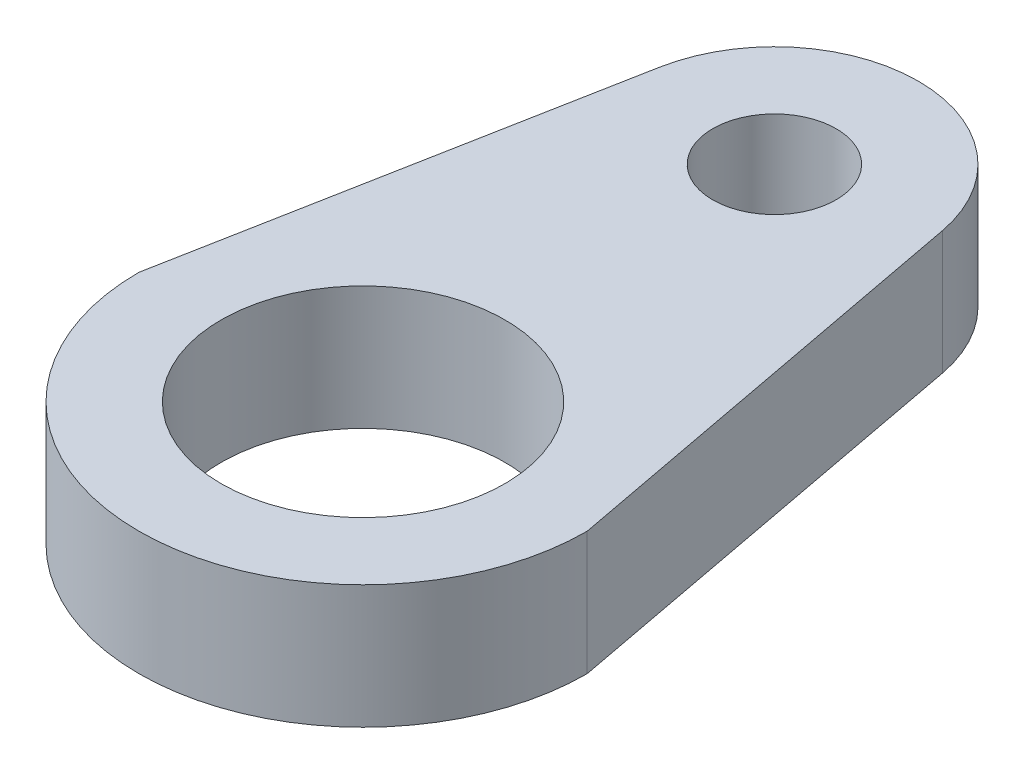
ISO-10303-21;
HEADER;
FILE_DESCRIPTION(('STEP AP214'),'2;1');
FILE_NAME('part.step','',(''),(''),'','','');
FILE_SCHEMA(('AUTOMOTIVE_DESIGN { 1 0 10303 214 1 1 1 1 }'));
ENDSEC;
DATA;
#1=APPLICATION_CONTEXT('core data for automotive mechanical design processes');
#2=APPLICATION_PROTOCOL_DEFINITION('international standard','automotive_design',2000,#1);
#3=PRODUCT_CONTEXT('',#1,'mechanical');
#4=PRODUCT('Part','Part','',(#3));
#5=PRODUCT_RELATED_PRODUCT_CATEGORY('part','',(#4));
#6=PRODUCT_DEFINITION_FORMATION('','',#4);
#7=PRODUCT_DEFINITION_CONTEXT('part definition',#1,'design');
#8=PRODUCT_DEFINITION('design','',#6,#7);
#9=PRODUCT_DEFINITION_SHAPE('','',#8);
#10=(LENGTH_UNIT() NAMED_UNIT(*) SI_UNIT(.MILLI.,.METRE.));
#11=(NAMED_UNIT(*) PLANE_ANGLE_UNIT() SI_UNIT($,.RADIAN.));
#12=(NAMED_UNIT(*) SI_UNIT($,.STERADIAN.) SOLID_ANGLE_UNIT());
#13=UNCERTAINTY_MEASURE_WITH_UNIT(LENGTH_MEASURE(1.E-05),#10,'distance_accuracy_value','');
#14=(GEOMETRIC_REPRESENTATION_CONTEXT(3) GLOBAL_UNCERTAINTY_ASSIGNED_CONTEXT((#13)) GLOBAL_UNIT_ASSIGNED_CONTEXT((#10,
#11,#12)) REPRESENTATION_CONTEXT('',''));
#15=CARTESIAN_POINT('',(0.,0.,0.));
#16=DIRECTION('',(0.,0.,1.));
#17=DIRECTION('',(1.,0.,0.));
#18=AXIS2_PLACEMENT_3D('',#15,#16,#17);
#19=CARTESIAN_POINT('',(0.,1.5,0.));
#20=DIRECTION('',(0.,1.,0.));
#21=DIRECTION('',(0.,0.,1.));
#22=AXIS2_PLACEMENT_3D('',#19,#20,#21);
#23=PLANE('',#22);
#24=CARTESIAN_POINT('',(0.,1.5,0.));
#25=DIRECTION('',(0.,1.,0.));
#26=DIRECTION('',(0.,0.,1.));
#27=AXIS2_PLACEMENT_3D('',#24,#25,#26);
#28=CIRCLE('',#27,3.45);
#29=CARTESIAN_POINT('',(0.,1.5,3.45));
#30=VERTEX_POINT('',#29);
#31=EDGE_CURVE('E102',#30,#30,#28,.T.);
#32=ORIENTED_EDGE('',*,*,#31,.F.);
#33=EDGE_LOOP('',(#32));
#34=FACE_BOUND('',#33,.T.);
#35=CARTESIAN_POINT('',(0.,1.5,0.));
#36=DIRECTION('',(0.,1.,0.));
#37=DIRECTION('',(0.,0.,1.));
#38=AXIS2_PLACEMENT_3D('',#35,#36,#37);
#39=CIRCLE('',#38,5.45);
#40=CARTESIAN_POINT('',(-5.45,1.5,0.));
#41=VERTEX_POINT('',#40);
#42=CARTESIAN_POINT('',(5.45,1.5,0.));
#43=VERTEX_POINT('',#42);
#44=EDGE_CURVE('E87',#41,#43,#39,.T.);
#45=ORIENTED_EDGE('',*,*,#44,.T.);
#46=DIRECTION('',(-0.185537287359745,0.,-0.982637224513293));
#47=VECTOR('',#46,1.);
#48=CARTESIAN_POINT('',(5.45,1.5,0.));
#49=LINE('',#48,#47);
#50=CARTESIAN_POINT('',(3.43923028579652,1.5,-10.6493805057591));
#51=VERTEX_POINT('',#50);
#52=EDGE_CURVE('E82',#43,#51,#49,.T.);
#53=ORIENTED_EDGE('',*,*,#52,.T.);
#54=CARTESIAN_POINT('',(0.,1.5,-10.));
#55=DIRECTION('',(0.,1.,0.));
#56=DIRECTION('',(0.,0.,1.));
#57=AXIS2_PLACEMENT_3D('',#54,#55,#56);
#58=CIRCLE('',#57,3.5);
#59=CARTESIAN_POINT('',(-3.43923028579652,1.5,-10.6493805057591));
#60=VERTEX_POINT('',#59);
#61=EDGE_CURVE('E85',#51,#60,#58,.T.);
#62=ORIENTED_EDGE('',*,*,#61,.T.);
#63=DIRECTION('',(-0.185537287359745,0.,0.982637224513293));
#64=VECTOR('',#63,1.);
#65=CARTESIAN_POINT('',(-5.45,1.5,0.));
#66=LINE('',#65,#64);
#67=EDGE_CURVE('E52',#60,#41,#66,.T.);
#68=ORIENTED_EDGE('',*,*,#67,.T.);
#69=EDGE_LOOP('',(#45,#53,#62,#68));
#70=FACE_BOUND('',#69,.T.);
#71=CARTESIAN_POINT('',(0.,1.5,-10.));
#72=DIRECTION('',(0.,1.,0.));
#73=DIRECTION('',(0.,0.,1.));
#74=AXIS2_PLACEMENT_3D('',#71,#72,#73);
#75=CIRCLE('',#74,1.5);
#76=CARTESIAN_POINT('',(0.,1.5,-8.5));
#77=VERTEX_POINT('',#76);
#78=EDGE_CURVE('E117',#77,#77,#75,.T.);
#79=ORIENTED_EDGE('',*,*,#78,.F.);
#80=EDGE_LOOP('',(#79));
#81=FACE_BOUND('',#80,.T.);
#82=ADVANCED_FACE('F35',(#34,#70,#81),#23,.T.);
#83=CARTESIAN_POINT('',(0.,-1.5,0.));
#84=DIRECTION('',(0.,1.,0.));
#85=DIRECTION('',(0.,0.,1.));
#86=AXIS2_PLACEMENT_3D('',#83,#84,#85);
#87=PLANE('',#86);
#88=CARTESIAN_POINT('',(0.,-1.5,0.));
#89=DIRECTION('',(0.,1.,0.));
#90=DIRECTION('',(0.,0.,1.));
#91=AXIS2_PLACEMENT_3D('',#88,#89,#90);
#92=CIRCLE('',#91,5.45);
#93=CARTESIAN_POINT('',(-5.45,-1.5,0.));
#94=VERTEX_POINT('',#93);
#95=CARTESIAN_POINT('',(5.45,-1.5,0.));
#96=VERTEX_POINT('',#95);
#97=EDGE_CURVE('E99',#94,#96,#92,.T.);
#98=ORIENTED_EDGE('',*,*,#97,.F.);
#99=DIRECTION('',(-0.185537287359745,0.,0.982637224513293));
#100=VECTOR('',#99,1.);
#101=CARTESIAN_POINT('',(-5.45,-1.5,0.));
#102=LINE('',#101,#100);
#103=CARTESIAN_POINT('',(-3.43923028579652,-1.5,-10.6493805057591));
#104=VERTEX_POINT('',#103);
#105=EDGE_CURVE('E75',#104,#94,#102,.T.);
#106=ORIENTED_EDGE('',*,*,#105,.F.);
#107=CARTESIAN_POINT('',(0.,-1.5,-10.));
#108=DIRECTION('',(0.,1.,0.));
#109=DIRECTION('',(0.,0.,1.));
#110=AXIS2_PLACEMENT_3D('',#107,#108,#109);
#111=CIRCLE('',#110,3.5);
#112=CARTESIAN_POINT('',(3.43923028579652,-1.5,-10.6493805057591));
#113=VERTEX_POINT('',#112);
#114=EDGE_CURVE('E69',#113,#104,#111,.T.);
#115=ORIENTED_EDGE('',*,*,#114,.F.);
#116=DIRECTION('',(-0.185537287359745,0.,-0.982637224513293));
#117=VECTOR('',#116,1.);
#118=CARTESIAN_POINT('',(5.45,-1.5,0.));
#119=LINE('',#118,#117);
#120=EDGE_CURVE('E91',#96,#113,#119,.T.);
#121=ORIENTED_EDGE('',*,*,#120,.F.);
#122=EDGE_LOOP('',(#98,#106,#115,#121));
#123=FACE_BOUND('',#122,.T.);
#124=CARTESIAN_POINT('',(0.,-1.5,0.));
#125=DIRECTION('',(0.,1.,0.));
#126=DIRECTION('',(0.,0.,1.));
#127=AXIS2_PLACEMENT_3D('',#124,#125,#126);
#128=CIRCLE('',#127,3.45);
#129=CARTESIAN_POINT('',(0.,-1.5,3.45));
#130=VERTEX_POINT('',#129);
#131=EDGE_CURVE('E114',#130,#130,#128,.T.);
#132=ORIENTED_EDGE('',*,*,#131,.T.);
#133=EDGE_LOOP('',(#132));
#134=FACE_BOUND('',#133,.T.);
#135=CARTESIAN_POINT('',(0.,-1.5,-10.));
#136=DIRECTION('',(0.,1.,0.));
#137=DIRECTION('',(0.,0.,1.));
#138=AXIS2_PLACEMENT_3D('',#135,#136,#137);
#139=CIRCLE('',#138,1.5);
#140=CARTESIAN_POINT('',(0.,-1.5,-8.5));
#141=VERTEX_POINT('',#140);
#142=EDGE_CURVE('E120',#141,#141,#139,.T.);
#143=ORIENTED_EDGE('',*,*,#142,.T.);
#144=EDGE_LOOP('',(#143));
#145=FACE_BOUND('',#144,.T.);
#146=ADVANCED_FACE('F110',(#123,#134,#145),#87,.F.);
#147=CARTESIAN_POINT('',(0.,1.5,0.));
#148=DIRECTION('',(0.,-1.,0.));
#149=DIRECTION('',(0.,0.,-1.));
#150=AXIS2_PLACEMENT_3D('',#147,#148,#149);
#151=CYLINDRICAL_SURFACE('',#150,5.45);
#152=ORIENTED_EDGE('',*,*,#97,.T.);
#153=DIRECTION('',(0.,-1.,0.));
#154=VECTOR('',#153,1.);
#155=CARTESIAN_POINT('',(5.45,1.5,0.));
#156=LINE('',#155,#154);
#157=EDGE_CURVE('E11',#43,#96,#156,.T.);
#158=ORIENTED_EDGE('',*,*,#157,.F.);
#159=ORIENTED_EDGE('',*,*,#44,.F.);
#160=DIRECTION('',(0.,-1.,0.));
#161=VECTOR('',#160,1.);
#162=CARTESIAN_POINT('',(-5.45,1.5,0.));
#163=LINE('',#162,#161);
#164=EDGE_CURVE('E95',#41,#94,#163,.T.);
#165=ORIENTED_EDGE('',*,*,#164,.T.);
#166=EDGE_LOOP('',(#152,#158,#159,#165));
#167=FACE_BOUND('',#166,.T.);
#168=ADVANCED_FACE('F37',(#167),#151,.T.);
#169=CARTESIAN_POINT('',(5.45,1.5,0.));
#170=DIRECTION('',(-0.982637224513293,0.,0.185537287359745));
#171=DIRECTION('',(0.185537287359745,0.,0.982637224513293));
#172=AXIS2_PLACEMENT_3D('',#169,#170,#171);
#173=PLANE('',#172);
#174=ORIENTED_EDGE('',*,*,#120,.T.);
#175=DIRECTION('',(0.,-1.,0.));
#176=VECTOR('',#175,1.);
#177=CARTESIAN_POINT('',(3.43923028579652,1.5,-10.6493805057591));
#178=LINE('',#177,#176);
#179=EDGE_CURVE('E44',#51,#113,#178,.T.);
#180=ORIENTED_EDGE('',*,*,#179,.F.);
#181=ORIENTED_EDGE('',*,*,#52,.F.);
#182=ORIENTED_EDGE('',*,*,#157,.T.);
#183=EDGE_LOOP('',(#174,#180,#181,#182));
#184=FACE_BOUND('',#183,.T.);
#185=ADVANCED_FACE('F90',(#184),#173,.F.);
#186=CARTESIAN_POINT('',(0.,1.5,-10.));
#187=DIRECTION('',(0.,-1.,0.));
#188=DIRECTION('',(0.,0.,-1.));
#189=AXIS2_PLACEMENT_3D('',#186,#187,#188);
#190=CYLINDRICAL_SURFACE('',#189,3.5);
#191=ORIENTED_EDGE('',*,*,#114,.T.);
#192=DIRECTION('',(0.,-1.,0.));
#193=VECTOR('',#192,1.);
#194=CARTESIAN_POINT('',(-3.43923028579652,1.5,-10.6493805057591));
#195=LINE('',#194,#193);
#196=EDGE_CURVE('E92',#60,#104,#195,.T.);
#197=ORIENTED_EDGE('',*,*,#196,.F.);
#198=ORIENTED_EDGE('',*,*,#61,.F.);
#199=ORIENTED_EDGE('',*,*,#179,.T.);
#200=EDGE_LOOP('',(#191,#197,#198,#199));
#201=FACE_BOUND('',#200,.T.);
#202=ADVANCED_FACE('F93',(#201),#190,.T.);
#203=CARTESIAN_POINT('',(-5.45,1.5,0.));
#204=DIRECTION('',(0.982637224513293,0.,0.185537287359745));
#205=DIRECTION('',(0.185537287359745,0.,-0.982637224513293));
#206=AXIS2_PLACEMENT_3D('',#203,#204,#205);
#207=PLANE('',#206);
#208=ORIENTED_EDGE('',*,*,#105,.T.);
#209=ORIENTED_EDGE('',*,*,#164,.F.);
#210=ORIENTED_EDGE('',*,*,#67,.F.);
#211=ORIENTED_EDGE('',*,*,#196,.T.);
#212=EDGE_LOOP('',(#208,#209,#210,#211));
#213=FACE_BOUND('',#212,.T.);
#214=ADVANCED_FACE('F107',(#213),#207,.F.);
#215=CARTESIAN_POINT('',(0.,1.5,0.));
#216=DIRECTION('',(0.,-1.,0.));
#217=DIRECTION('',(0.,0.,-1.));
#218=AXIS2_PLACEMENT_3D('',#215,#216,#217);
#219=CYLINDRICAL_SURFACE('',#218,3.45);
#220=ORIENTED_EDGE('',*,*,#31,.T.);
#221=EDGE_LOOP('',(#220));
#222=FACE_BOUND('',#221,.T.);
#223=ORIENTED_EDGE('',*,*,#131,.F.);
#224=EDGE_LOOP('',(#223));
#225=FACE_BOUND('',#224,.T.);
#226=ADVANCED_FACE('F137',(#222,#225),#219,.F.);
#227=CARTESIAN_POINT('',(0.,1.5,-10.));
#228=DIRECTION('',(0.,-1.,0.));
#229=DIRECTION('',(0.,0.,-1.));
#230=AXIS2_PLACEMENT_3D('',#227,#228,#229);
#231=CYLINDRICAL_SURFACE('',#230,1.5);
#232=ORIENTED_EDGE('',*,*,#78,.T.);
#233=EDGE_LOOP('',(#232));
#234=FACE_BOUND('',#233,.T.);
#235=ORIENTED_EDGE('',*,*,#142,.F.);
#236=EDGE_LOOP('',(#235));
#237=FACE_BOUND('',#236,.T.);
#238=ADVANCED_FACE('F126',(#234,#237),#231,.F.);
#239=CLOSED_SHELL('',(#82,#146,#168,#185,#202,#214,#226,#238));
#240=MANIFOLD_SOLID_BREP('B2',#239);
#241=ADVANCED_BREP_SHAPE_REPRESENTATION('',(#18,#240),#14);
#242=SHAPE_DEFINITION_REPRESENTATION(#9,#241);
ENDSEC;
END-ISO-10303-21;
